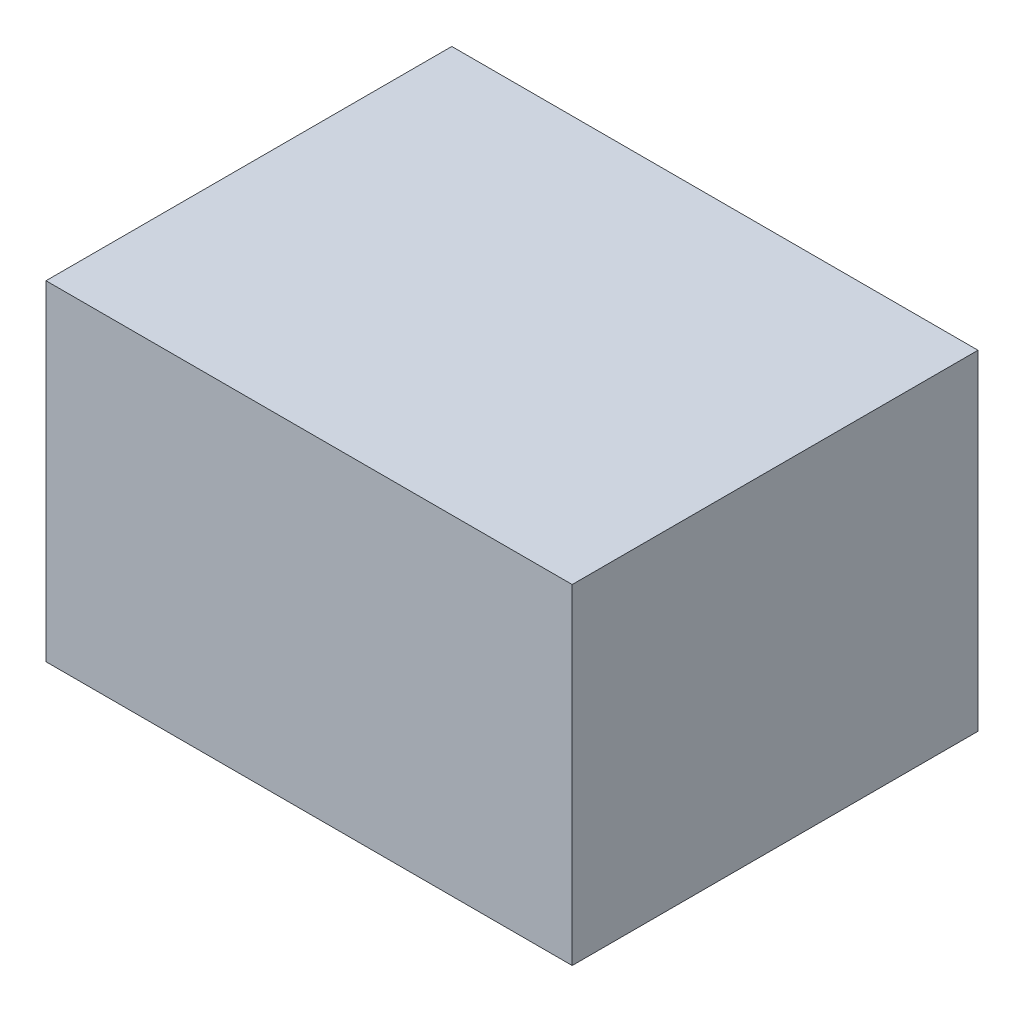
ISO-10303-21;
HEADER;
FILE_DESCRIPTION(('STEP AP214'),'2;1');
FILE_NAME('part.step','',(''),(''),'','','');
FILE_SCHEMA(('AUTOMOTIVE_DESIGN { 1 0 10303 214 1 1 1 1 }'));
ENDSEC;
DATA;
#1=APPLICATION_CONTEXT('core data for automotive mechanical design processes');
#2=APPLICATION_PROTOCOL_DEFINITION('international standard','automotive_design',2000,#1);
#3=PRODUCT_CONTEXT('',#1,'mechanical');
#4=PRODUCT('Part','Part','',(#3));
#5=PRODUCT_RELATED_PRODUCT_CATEGORY('part','',(#4));
#6=PRODUCT_DEFINITION_FORMATION('','',#4);
#7=PRODUCT_DEFINITION_CONTEXT('part definition',#1,'design');
#8=PRODUCT_DEFINITION('design','',#6,#7);
#9=PRODUCT_DEFINITION_SHAPE('','',#8);
#10=(LENGTH_UNIT() NAMED_UNIT(*) SI_UNIT(.MILLI.,.METRE.));
#11=(NAMED_UNIT(*) PLANE_ANGLE_UNIT() SI_UNIT($,.RADIAN.));
#12=(NAMED_UNIT(*) SI_UNIT($,.STERADIAN.) SOLID_ANGLE_UNIT());
#13=UNCERTAINTY_MEASURE_WITH_UNIT(LENGTH_MEASURE(1.E-05),#10,'distance_accuracy_value','');
#14=(GEOMETRIC_REPRESENTATION_CONTEXT(3) GLOBAL_UNCERTAINTY_ASSIGNED_CONTEXT((#13)) GLOBAL_UNIT_ASSIGNED_CONTEXT((#10,
#11,#12)) REPRESENTATION_CONTEXT('',''));
#15=CARTESIAN_POINT('',(0.,0.,0.));
#16=DIRECTION('',(0.,0.,1.));
#17=DIRECTION('',(1.,0.,0.));
#18=AXIS2_PLACEMENT_3D('',#15,#16,#17);
#19=CARTESIAN_POINT('',(0.,3.7,0.));
#20=DIRECTION('',(1.,0.,0.));
#21=DIRECTION('',(0.,0.,-1.));
#22=AXIS2_PLACEMENT_3D('',#19,#20,#21);
#23=PLANE('',#22);
#24=DIRECTION('',(0.,0.,1.));
#25=VECTOR('',#24,1.);
#26=CARTESIAN_POINT('',(0.,0.,0.));
#27=LINE('',#26,#25);
#28=CARTESIAN_POINT('',(0.,0.,-4.55));
#29=VERTEX_POINT('',#28);
#30=CARTESIAN_POINT('',(0.,0.,0.));
#31=VERTEX_POINT('',#30);
#32=EDGE_CURVE('E95',#29,#31,#27,.T.);
#33=ORIENTED_EDGE('',*,*,#32,.T.);
#34=DIRECTION('',(0.,-1.,0.));
#35=VECTOR('',#34,1.);
#36=CARTESIAN_POINT('',(0.,3.7,0.));
#37=LINE('',#36,#35);
#38=CARTESIAN_POINT('',(0.,3.7,0.));
#39=VERTEX_POINT('',#38);
#40=EDGE_CURVE('E11',#39,#31,#37,.T.);
#41=ORIENTED_EDGE('',*,*,#40,.F.);
#42=DIRECTION('',(0.,0.,1.));
#43=VECTOR('',#42,1.);
#44=CARTESIAN_POINT('',(0.,3.7,0.));
#45=LINE('',#44,#43);
#46=CARTESIAN_POINT('',(0.,3.7,-4.55));
#47=VERTEX_POINT('',#46);
#48=EDGE_CURVE('E83',#47,#39,#45,.T.);
#49=ORIENTED_EDGE('',*,*,#48,.F.);
#50=DIRECTION('',(0.,-1.,0.));
#51=VECTOR('',#50,1.);
#52=CARTESIAN_POINT('',(0.,3.7,-4.55));
#53=LINE('',#52,#51);
#54=EDGE_CURVE('E91',#47,#29,#53,.T.);
#55=ORIENTED_EDGE('',*,*,#54,.T.);
#56=EDGE_LOOP('',(#33,#41,#49,#55));
#57=FACE_BOUND('',#56,.T.);
#58=ADVANCED_FACE('F32',(#57),#23,.F.);
#59=CARTESIAN_POINT('',(0.,3.7,0.));
#60=DIRECTION('',(0.,0.,-1.));
#61=DIRECTION('',(-1.,0.,0.));
#62=AXIS2_PLACEMENT_3D('',#59,#60,#61);
#63=PLANE('',#62);
#64=DIRECTION('',(1.,0.,0.));
#65=VECTOR('',#64,1.);
#66=CARTESIAN_POINT('',(0.,0.,0.));
#67=LINE('',#66,#65);
#68=CARTESIAN_POINT('',(5.9,0.,0.));
#69=VERTEX_POINT('',#68);
#70=EDGE_CURVE('E87',#31,#69,#67,.T.);
#71=ORIENTED_EDGE('',*,*,#70,.T.);
#72=DIRECTION('',(0.,-1.,0.));
#73=VECTOR('',#72,1.);
#74=CARTESIAN_POINT('',(5.9,3.7,0.));
#75=LINE('',#74,#73);
#76=CARTESIAN_POINT('',(5.9,3.7,0.));
#77=VERTEX_POINT('',#76);
#78=EDGE_CURVE('E40',#77,#69,#75,.T.);
#79=ORIENTED_EDGE('',*,*,#78,.F.);
#80=DIRECTION('',(1.,0.,0.));
#81=VECTOR('',#80,1.);
#82=CARTESIAN_POINT('',(0.,3.7,0.));
#83=LINE('',#82,#81);
#84=EDGE_CURVE('E78',#39,#77,#83,.T.);
#85=ORIENTED_EDGE('',*,*,#84,.F.);
#86=ORIENTED_EDGE('',*,*,#40,.T.);
#87=EDGE_LOOP('',(#71,#79,#85,#86));
#88=FACE_BOUND('',#87,.T.);
#89=ADVANCED_FACE('F86',(#88),#63,.F.);
#90=CARTESIAN_POINT('',(5.9,3.7,0.));
#91=DIRECTION('',(-1.,0.,0.));
#92=DIRECTION('',(0.,0.,1.));
#93=AXIS2_PLACEMENT_3D('',#90,#91,#92);
#94=PLANE('',#93);
#95=DIRECTION('',(0.,0.,-1.));
#96=VECTOR('',#95,1.);
#97=CARTESIAN_POINT('',(5.9,0.,0.));
#98=LINE('',#97,#96);
#99=CARTESIAN_POINT('',(5.9,0.,-4.55));
#100=VERTEX_POINT('',#99);
#101=EDGE_CURVE('E65',#69,#100,#98,.T.);
#102=ORIENTED_EDGE('',*,*,#101,.T.);
#103=DIRECTION('',(0.,-1.,0.));
#104=VECTOR('',#103,1.);
#105=CARTESIAN_POINT('',(5.9,3.7,-4.55));
#106=LINE('',#105,#104);
#107=CARTESIAN_POINT('',(5.9,3.7,-4.55));
#108=VERTEX_POINT('',#107);
#109=EDGE_CURVE('E88',#108,#100,#106,.T.);
#110=ORIENTED_EDGE('',*,*,#109,.F.);
#111=DIRECTION('',(0.,0.,-1.));
#112=VECTOR('',#111,1.);
#113=CARTESIAN_POINT('',(5.9,3.7,0.));
#114=LINE('',#113,#112);
#115=EDGE_CURVE('E81',#77,#108,#114,.T.);
#116=ORIENTED_EDGE('',*,*,#115,.F.);
#117=ORIENTED_EDGE('',*,*,#78,.T.);
#118=EDGE_LOOP('',(#102,#110,#116,#117));
#119=FACE_BOUND('',#118,.T.);
#120=ADVANCED_FACE('F89',(#119),#94,.F.);
#121=CARTESIAN_POINT('',(0.,3.7,-4.55));
#122=DIRECTION('',(0.,0.,1.));
#123=DIRECTION('',(1.,0.,0.));
#124=AXIS2_PLACEMENT_3D('',#121,#122,#123);
#125=PLANE('',#124);
#126=DIRECTION('',(-1.,0.,0.));
#127=VECTOR('',#126,1.);
#128=CARTESIAN_POINT('',(0.,0.,-4.55));
#129=LINE('',#128,#127);
#130=EDGE_CURVE('E71',#100,#29,#129,.T.);
#131=ORIENTED_EDGE('',*,*,#130,.T.);
#132=ORIENTED_EDGE('',*,*,#54,.F.);
#133=DIRECTION('',(-1.,0.,0.));
#134=VECTOR('',#133,1.);
#135=CARTESIAN_POINT('',(0.,3.7,-4.55));
#136=LINE('',#135,#134);
#137=EDGE_CURVE('E48',#108,#47,#136,.T.);
#138=ORIENTED_EDGE('',*,*,#137,.F.);
#139=ORIENTED_EDGE('',*,*,#109,.T.);
#140=EDGE_LOOP('',(#131,#132,#138,#139));
#141=FACE_BOUND('',#140,.T.);
#142=ADVANCED_FACE('F102',(#141),#125,.F.);
#143=CARTESIAN_POINT('',(0.,3.7,0.));
#144=DIRECTION('',(0.,-1.,0.));
#145=DIRECTION('',(0.,0.,-1.));
#146=AXIS2_PLACEMENT_3D('',#143,#144,#145);
#147=PLANE('',#146);
#148=ORIENTED_EDGE('',*,*,#48,.T.);
#149=ORIENTED_EDGE('',*,*,#84,.T.);
#150=ORIENTED_EDGE('',*,*,#115,.T.);
#151=ORIENTED_EDGE('',*,*,#137,.T.);
#152=EDGE_LOOP('',(#148,#149,#150,#151));
#153=FACE_BOUND('',#152,.T.);
#154=ADVANCED_FACE('F79',(#153),#147,.F.);
#155=CARTESIAN_POINT('',(0.,0.,0.));
#156=DIRECTION('',(0.,-1.,0.));
#157=DIRECTION('',(0.,0.,-1.));
#158=AXIS2_PLACEMENT_3D('',#155,#156,#157);
#159=PLANE('',#158);
#160=ORIENTED_EDGE('',*,*,#32,.F.);
#161=ORIENTED_EDGE('',*,*,#130,.F.);
#162=ORIENTED_EDGE('',*,*,#101,.F.);
#163=ORIENTED_EDGE('',*,*,#70,.F.);
#164=EDGE_LOOP('',(#160,#161,#162,#163));
#165=FACE_BOUND('',#164,.T.);
#166=ADVANCED_FACE('F105',(#165),#159,.T.);
#167=CLOSED_SHELL('',(#58,#89,#120,#142,#154,#166));
#168=MANIFOLD_SOLID_BREP('B2',#167);
#169=ADVANCED_BREP_SHAPE_REPRESENTATION('',(#18,#168),#14);
#170=SHAPE_DEFINITION_REPRESENTATION(#9,#169);
ENDSEC;
END-ISO-10303-21;
